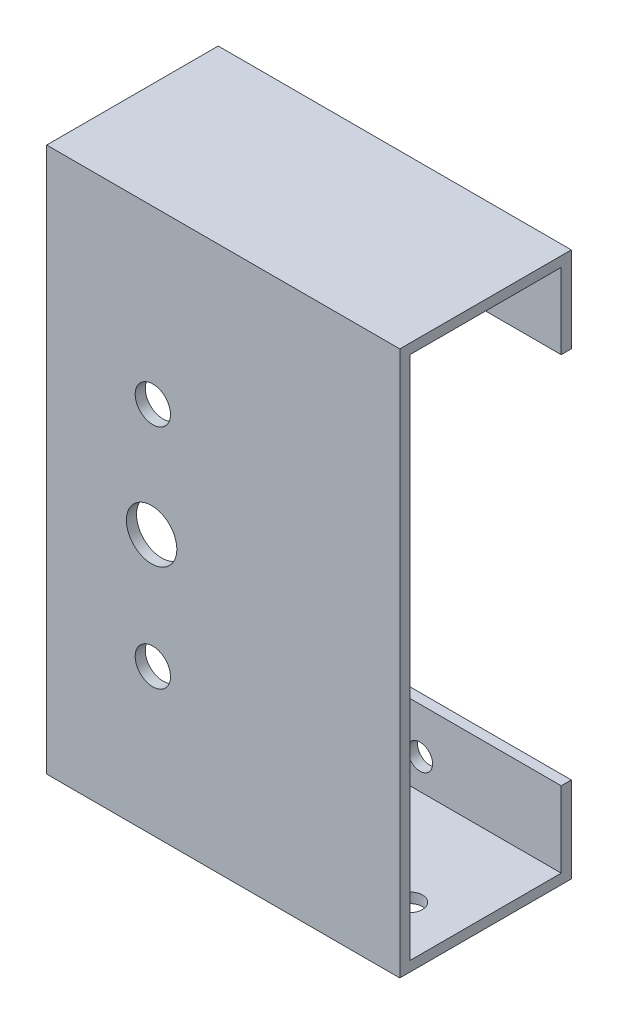
ISO-10303-21;
HEADER;
FILE_DESCRIPTION(('STEP AP214'),'2;1');
FILE_NAME('part.step','',(''),(''),'','','');
FILE_SCHEMA(('AUTOMOTIVE_DESIGN { 1 0 10303 214 1 1 1 1 }'));
ENDSEC;
DATA;
#1=APPLICATION_CONTEXT('core data for automotive mechanical design processes');
#2=APPLICATION_PROTOCOL_DEFINITION('international standard','automotive_design',2000,#1);
#3=PRODUCT_CONTEXT('',#1,'mechanical');
#4=PRODUCT('Part','Part','',(#3));
#5=PRODUCT_RELATED_PRODUCT_CATEGORY('part','',(#4));
#6=PRODUCT_DEFINITION_FORMATION('','',#4);
#7=PRODUCT_DEFINITION_CONTEXT('part definition',#1,'design');
#8=PRODUCT_DEFINITION('design','',#6,#7);
#9=PRODUCT_DEFINITION_SHAPE('','',#8);
#10=(LENGTH_UNIT() NAMED_UNIT(*) SI_UNIT(.MILLI.,.METRE.));
#11=(NAMED_UNIT(*) PLANE_ANGLE_UNIT() SI_UNIT($,.RADIAN.));
#12=(NAMED_UNIT(*) SI_UNIT($,.STERADIAN.) SOLID_ANGLE_UNIT());
#13=UNCERTAINTY_MEASURE_WITH_UNIT(LENGTH_MEASURE(1.E-05),#10,'distance_accuracy_value','');
#14=(GEOMETRIC_REPRESENTATION_CONTEXT(3) GLOBAL_UNCERTAINTY_ASSIGNED_CONTEXT((#13)) GLOBAL_UNIT_ASSIGNED_CONTEXT((#10,
#11,#12)) REPRESENTATION_CONTEXT('',''));
#15=CARTESIAN_POINT('',(0.,0.,0.));
#16=DIRECTION('',(0.,0.,1.));
#17=DIRECTION('',(1.,0.,0.));
#18=AXIS2_PLACEMENT_3D('',#15,#16,#17);
#19=CARTESIAN_POINT('',(0.,0.,0.));
#20=DIRECTION('',(0.,0.,1.));
#21=DIRECTION('',(1.,0.,0.));
#22=AXIS2_PLACEMENT_3D('',#19,#20,#21);
#23=PLANE('',#22);
#24=CARTESIAN_POINT('',(-13.9545492573854,20.0000000000015,0.));
#25=DIRECTION('',(0.,0.,1.));
#26=DIRECTION('',(1.,0.,0.));
#27=AXIS2_PLACEMENT_3D('',#24,#25,#26);
#28=CIRCLE('',#27,3.5);
#29=CARTESIAN_POINT('',(-10.4545492573854,20.0000000000015,0.));
#30=VERTEX_POINT('',#29);
#31=EDGE_CURVE('E557',#30,#30,#28,.T.);
#32=ORIENTED_EDGE('',*,*,#31,.T.);
#33=EDGE_LOOP('',(#32));
#34=FACE_BOUND('',#33,.T.);
#35=CARTESIAN_POINT('',(-13.9545492573854,-24.9999999999985,0.));
#36=DIRECTION('',(0.,0.,1.));
#37=DIRECTION('',(1.,0.,0.));
#38=AXIS2_PLACEMENT_3D('',#35,#36,#37);
#39=CIRCLE('',#38,3.5);
#40=CARTESIAN_POINT('',(-10.4545492573854,-24.9999999999985,0.));
#41=VERTEX_POINT('',#40);
#42=EDGE_CURVE('E549',#41,#41,#39,.T.);
#43=ORIENTED_EDGE('',*,*,#42,.T.);
#44=EDGE_LOOP('',(#43));
#45=FACE_BOUND('',#44,.T.);
#46=CARTESIAN_POINT('',(-14.1999999999985,-2.49999999999849,0.));
#47=DIRECTION('',(0.,0.,1.));
#48=DIRECTION('',(1.,0.,0.));
#49=AXIS2_PLACEMENT_3D('',#46,#47,#48);
#50=CIRCLE('',#49,5.);
#51=CARTESIAN_POINT('',(-9.19999999999849,-2.49999999999849,0.));
#52=VERTEX_POINT('',#51);
#53=EDGE_CURVE('E564',#52,#52,#50,.T.);
#54=ORIENTED_EDGE('',*,*,#53,.T.);
#55=EDGE_LOOP('',(#54));
#56=FACE_BOUND('',#55,.T.);
#57=DIRECTION('',(0.,-1.,0.));
#58=VECTOR('',#57,1.);
#59=CARTESIAN_POINT('',(-35.,-54.,0.));
#60=LINE('',#59,#58);
#61=CARTESIAN_POINT('',(-35.,52.,0.));
#62=VERTEX_POINT('',#61);
#63=CARTESIAN_POINT('',(-35.,-52.,0.));
#64=VERTEX_POINT('',#63);
#65=EDGE_CURVE('E54',#62,#64,#60,.T.);
#66=ORIENTED_EDGE('',*,*,#65,.F.);
#67=DIRECTION('',(1.,0.,0.));
#68=VECTOR('',#67,1.);
#69=CARTESIAN_POINT('',(35.,52.,0.));
#70=LINE('',#69,#68);
#71=CARTESIAN_POINT('',(35.,52.,0.));
#72=VERTEX_POINT('',#71);
#73=EDGE_CURVE('E141',#62,#72,#70,.T.);
#74=ORIENTED_EDGE('',*,*,#73,.T.);
#75=DIRECTION('',(0.,1.,0.));
#76=VECTOR('',#75,1.);
#77=CARTESIAN_POINT('',(35.,-54.,0.));
#78=LINE('',#77,#76);
#79=CARTESIAN_POINT('',(35.,-52.,0.));
#80=VERTEX_POINT('',#79);
#81=EDGE_CURVE('E241',#80,#72,#78,.T.);
#82=ORIENTED_EDGE('',*,*,#81,.F.);
#83=DIRECTION('',(1.,0.,0.));
#84=VECTOR('',#83,1.);
#85=CARTESIAN_POINT('',(35.,-52.,0.));
#86=LINE('',#85,#84);
#87=EDGE_CURVE('E221',#64,#80,#86,.T.);
#88=ORIENTED_EDGE('',*,*,#87,.F.);
#89=EDGE_LOOP('',(#66,#74,#82,#88));
#90=FACE_BOUND('',#89,.T.);
#91=ADVANCED_FACE('F38',(#34,#45,#56,#90),#23,.F.);
#92=CARTESIAN_POINT('',(-35.,-54.,2.));
#93=DIRECTION('',(1.,0.,0.));
#94=DIRECTION('',(0.,0.,-1.));
#95=AXIS2_PLACEMENT_3D('',#92,#93,#94);
#96=PLANE('',#95);
#97=DIRECTION('',(0.,0.,-1.));
#98=VECTOR('',#97,1.);
#99=CARTESIAN_POINT('',(-35.,54.,2.));
#100=LINE('',#99,#98);
#101=CARTESIAN_POINT('',(-35.,54.,2.));
#102=VERTEX_POINT('',#101);
#103=CARTESIAN_POINT('',(-35.,54.,-32.));
#104=VERTEX_POINT('',#103);
#105=EDGE_CURVE('E249',#102,#104,#100,.T.);
#106=ORIENTED_EDGE('',*,*,#105,.T.);
#107=DIRECTION('',(0.,-1.,0.));
#108=VECTOR('',#107,1.);
#109=CARTESIAN_POINT('',(-35.,54.,-32.));
#110=LINE('',#109,#108);
#111=CARTESIAN_POINT('',(-35.,37.,-32.));
#112=VERTEX_POINT('',#111);
#113=EDGE_CURVE('E158',#104,#112,#110,.T.);
#114=ORIENTED_EDGE('',*,*,#113,.T.);
#115=DIRECTION('',(0.,0.,1.));
#116=VECTOR('',#115,1.);
#117=CARTESIAN_POINT('',(-35.,37.,-32.));
#118=LINE('',#117,#116);
#119=CARTESIAN_POINT('',(-35.,37.,-30.));
#120=VERTEX_POINT('',#119);
#121=EDGE_CURVE('E142',#112,#120,#118,.T.);
#122=ORIENTED_EDGE('',*,*,#121,.T.);
#123=DIRECTION('',(0.,-1.,0.));
#124=VECTOR('',#123,1.);
#125=CARTESIAN_POINT('',(-35.,54.,-30.));
#126=LINE('',#125,#124);
#127=CARTESIAN_POINT('',(-35.,52.,-30.));
#128=VERTEX_POINT('',#127);
#129=EDGE_CURVE('E153',#128,#120,#126,.T.);
#130=ORIENTED_EDGE('',*,*,#129,.F.);
#131=DIRECTION('',(0.,0.,1.));
#132=VECTOR('',#131,1.);
#133=CARTESIAN_POINT('',(-35.,52.,-30.));
#134=LINE('',#133,#132);
#135=EDGE_CURVE('E180',#128,#62,#134,.T.);
#136=ORIENTED_EDGE('',*,*,#135,.T.);
#137=ORIENTED_EDGE('',*,*,#65,.T.);
#138=DIRECTION('',(0.,0.,1.));
#139=VECTOR('',#138,1.);
#140=CARTESIAN_POINT('',(-35.,-52.,-30.));
#141=LINE('',#140,#139);
#142=CARTESIAN_POINT('',(-35.,-52.,-30.));
#143=VERTEX_POINT('',#142);
#144=EDGE_CURVE('E233',#143,#64,#141,.T.);
#145=ORIENTED_EDGE('',*,*,#144,.F.);
#146=DIRECTION('',(0.,1.,0.));
#147=VECTOR('',#146,1.);
#148=CARTESIAN_POINT('',(-35.,-54.,-30.));
#149=LINE('',#148,#147);
#150=CARTESIAN_POINT('',(-35.,-37.,-30.));
#151=VERTEX_POINT('',#150);
#152=EDGE_CURVE('E209',#143,#151,#149,.T.);
#153=ORIENTED_EDGE('',*,*,#152,.T.);
#154=DIRECTION('',(0.,0.,1.));
#155=VECTOR('',#154,1.);
#156=CARTESIAN_POINT('',(-35.,-37.,-32.));
#157=LINE('',#156,#155);
#158=CARTESIAN_POINT('',(-35.,-37.,-32.));
#159=VERTEX_POINT('',#158);
#160=EDGE_CURVE('E217',#159,#151,#157,.T.);
#161=ORIENTED_EDGE('',*,*,#160,.F.);
#162=DIRECTION('',(0.,1.,0.));
#163=VECTOR('',#162,1.);
#164=CARTESIAN_POINT('',(-35.,-54.,-32.));
#165=LINE('',#164,#163);
#166=CARTESIAN_POINT('',(-35.,-54.,-32.));
#167=VERTEX_POINT('',#166);
#168=EDGE_CURVE('E199',#167,#159,#165,.T.);
#169=ORIENTED_EDGE('',*,*,#168,.F.);
#170=DIRECTION('',(0.,0.,-1.));
#171=VECTOR('',#170,1.);
#172=CARTESIAN_POINT('',(-35.,-54.,2.));
#173=LINE('',#172,#171);
#174=CARTESIAN_POINT('',(-35.,-54.,2.));
#175=VERTEX_POINT('',#174);
#176=EDGE_CURVE('E11',#175,#167,#173,.T.);
#177=ORIENTED_EDGE('',*,*,#176,.F.);
#178=DIRECTION('',(0.,-1.,0.));
#179=VECTOR('',#178,1.);
#180=CARTESIAN_POINT('',(-35.,-54.,2.));
#181=LINE('',#180,#179);
#182=EDGE_CURVE('E237',#102,#175,#181,.T.);
#183=ORIENTED_EDGE('',*,*,#182,.F.);
#184=EDGE_LOOP('',(#106,#114,#122,#130,#136,#137,#145,#153,#161,#169,#177,#183));
#185=FACE_BOUND('',#184,.T.);
#186=ADVANCED_FACE('F40',(#185),#96,.F.);
#187=CARTESIAN_POINT('',(35.,-54.,2.));
#188=DIRECTION('',(0.,1.,0.));
#189=DIRECTION('',(-1.,0.,0.));
#190=AXIS2_PLACEMENT_3D('',#187,#188,#189);
#191=PLANE('',#190);
#192=CARTESIAN_POINT('',(25.,-54.,-10.));
#193=DIRECTION('',(0.,1.,0.));
#194=DIRECTION('',(-1.,0.,0.));
#195=AXIS2_PLACEMENT_3D('',#192,#193,#194);
#196=CIRCLE('',#195,2.5);
#197=CARTESIAN_POINT('',(22.5,-54.,-10.));
#198=VERTEX_POINT('',#197);
#199=EDGE_CURVE('E324',#198,#198,#196,.T.);
#200=ORIENTED_EDGE('',*,*,#199,.T.);
#201=EDGE_LOOP('',(#200));
#202=FACE_BOUND('',#201,.T.);
#203=CARTESIAN_POINT('',(-25.,-54.,-10.));
#204=DIRECTION('',(0.,1.,0.));
#205=DIRECTION('',(-1.,0.,0.));
#206=AXIS2_PLACEMENT_3D('',#203,#204,#205);
#207=CIRCLE('',#206,2.5);
#208=CARTESIAN_POINT('',(-27.5,-54.,-10.));
#209=VERTEX_POINT('',#208);
#210=EDGE_CURVE('E327',#209,#209,#207,.T.);
#211=ORIENTED_EDGE('',*,*,#210,.T.);
#212=EDGE_LOOP('',(#211));
#213=FACE_BOUND('',#212,.T.);
#214=ORIENTED_EDGE('',*,*,#176,.T.);
#215=DIRECTION('',(-1.,0.,0.));
#216=VECTOR('',#215,1.);
#217=CARTESIAN_POINT('',(35.,-54.,-32.));
#218=LINE('',#217,#216);
#219=CARTESIAN_POINT('',(35.,-54.,-32.));
#220=VERTEX_POINT('',#219);
#221=EDGE_CURVE('E194',#220,#167,#218,.T.);
#222=ORIENTED_EDGE('',*,*,#221,.F.);
#223=DIRECTION('',(0.,0.,-1.));
#224=VECTOR('',#223,1.);
#225=CARTESIAN_POINT('',(35.,-54.,2.));
#226=LINE('',#225,#224);
#227=CARTESIAN_POINT('',(35.,-54.,2.));
#228=VERTEX_POINT('',#227);
#229=EDGE_CURVE('E47',#228,#220,#226,.T.);
#230=ORIENTED_EDGE('',*,*,#229,.F.);
#231=DIRECTION('',(1.,0.,0.));
#232=VECTOR('',#231,1.);
#233=CARTESIAN_POINT('',(35.,-54.,2.));
#234=LINE('',#233,#232);
#235=EDGE_CURVE('E240',#175,#228,#234,.T.);
#236=ORIENTED_EDGE('',*,*,#235,.F.);
#237=EDGE_LOOP('',(#214,#222,#230,#236));
#238=FACE_BOUND('',#237,.T.);
#239=ADVANCED_FACE('F265',(#202,#213,#238),#191,.F.);
#240=CARTESIAN_POINT('',(35.,-54.,2.));
#241=DIRECTION('',(-1.,0.,0.));
#242=DIRECTION('',(0.,0.,1.));
#243=AXIS2_PLACEMENT_3D('',#240,#241,#242);
#244=PLANE('',#243);
#245=ORIENTED_EDGE('',*,*,#229,.T.);
#246=DIRECTION('',(0.,-1.,0.));
#247=VECTOR('',#246,1.);
#248=CARTESIAN_POINT('',(35.,-54.,-32.));
#249=LINE('',#248,#247);
#250=CARTESIAN_POINT('',(35.,-37.,-32.));
#251=VERTEX_POINT('',#250);
#252=EDGE_CURVE('E190',#251,#220,#249,.T.);
#253=ORIENTED_EDGE('',*,*,#252,.F.);
#254=DIRECTION('',(0.,0.,1.));
#255=VECTOR('',#254,1.);
#256=CARTESIAN_POINT('',(35.,-37.,-32.));
#257=LINE('',#256,#255);
#258=CARTESIAN_POINT('',(35.,-37.,-30.));
#259=VERTEX_POINT('',#258);
#260=EDGE_CURVE('E205',#251,#259,#257,.T.);
#261=ORIENTED_EDGE('',*,*,#260,.T.);
#262=DIRECTION('',(0.,-1.,0.));
#263=VECTOR('',#262,1.);
#264=CARTESIAN_POINT('',(35.,-54.,-30.));
#265=LINE('',#264,#263);
#266=CARTESIAN_POINT('',(35.,-52.,-30.));
#267=VERTEX_POINT('',#266);
#268=EDGE_CURVE('E189',#259,#267,#265,.T.);
#269=ORIENTED_EDGE('',*,*,#268,.T.);
#270=DIRECTION('',(0.,0.,1.));
#271=VECTOR('',#270,1.);
#272=CARTESIAN_POINT('',(35.,-52.,-30.));
#273=LINE('',#272,#271);
#274=EDGE_CURVE('E226',#267,#80,#273,.T.);
#275=ORIENTED_EDGE('',*,*,#274,.T.);
#276=ORIENTED_EDGE('',*,*,#81,.T.);
#277=DIRECTION('',(0.,0.,1.));
#278=VECTOR('',#277,1.);
#279=CARTESIAN_POINT('',(35.,52.,-30.));
#280=LINE('',#279,#278);
#281=CARTESIAN_POINT('',(35.,52.,-30.));
#282=VERTEX_POINT('',#281);
#283=EDGE_CURVE('E186',#282,#72,#280,.T.);
#284=ORIENTED_EDGE('',*,*,#283,.F.);
#285=DIRECTION('',(0.,1.,0.));
#286=VECTOR('',#285,1.);
#287=CARTESIAN_POINT('',(35.,54.,-30.));
#288=LINE('',#287,#286);
#289=CARTESIAN_POINT('',(35.,37.,-30.));
#290=VERTEX_POINT('',#289);
#291=EDGE_CURVE('E135',#290,#282,#288,.T.);
#292=ORIENTED_EDGE('',*,*,#291,.F.);
#293=DIRECTION('',(0.,0.,1.));
#294=VECTOR('',#293,1.);
#295=CARTESIAN_POINT('',(35.,37.,-32.));
#296=LINE('',#295,#294);
#297=CARTESIAN_POINT('',(35.,37.,-32.));
#298=VERTEX_POINT('',#297);
#299=EDGE_CURVE('E128',#298,#290,#296,.T.);
#300=ORIENTED_EDGE('',*,*,#299,.F.);
#301=DIRECTION('',(0.,1.,0.));
#302=VECTOR('',#301,1.);
#303=CARTESIAN_POINT('',(35.,54.,-32.));
#304=LINE('',#303,#302);
#305=CARTESIAN_POINT('',(35.,54.,-32.));
#306=VERTEX_POINT('',#305);
#307=EDGE_CURVE('E132',#298,#306,#304,.T.);
#308=ORIENTED_EDGE('',*,*,#307,.T.);
#309=DIRECTION('',(0.,0.,-1.));
#310=VECTOR('',#309,1.);
#311=CARTESIAN_POINT('',(35.,54.,2.));
#312=LINE('',#311,#310);
#313=CARTESIAN_POINT('',(35.,54.,2.));
#314=VERTEX_POINT('',#313);
#315=EDGE_CURVE('E257',#314,#306,#312,.T.);
#316=ORIENTED_EDGE('',*,*,#315,.F.);
#317=DIRECTION('',(0.,1.,0.));
#318=VECTOR('',#317,1.);
#319=CARTESIAN_POINT('',(35.,-54.,2.));
#320=LINE('',#319,#318);
#321=EDGE_CURVE('E244',#228,#314,#320,.T.);
#322=ORIENTED_EDGE('',*,*,#321,.F.);
#323=EDGE_LOOP('',(#245,#253,#261,#269,#275,#276,#284,#292,#300,#308,#316,#322));
#324=FACE_BOUND('',#323,.T.);
#325=ADVANCED_FACE('F130',(#324),#244,.F.);
#326=CARTESIAN_POINT('',(35.,54.,2.));
#327=DIRECTION('',(0.,-1.,0.));
#328=DIRECTION('',(1.,0.,0.));
#329=AXIS2_PLACEMENT_3D('',#326,#327,#328);
#330=PLANE('',#329);
#331=ORIENTED_EDGE('',*,*,#315,.T.);
#332=DIRECTION('',(-1.,0.,0.));
#333=VECTOR('',#332,1.);
#334=CARTESIAN_POINT('',(35.,54.,-32.));
#335=LINE('',#334,#333);
#336=EDGE_CURVE('E151',#306,#104,#335,.T.);
#337=ORIENTED_EDGE('',*,*,#336,.T.);
#338=ORIENTED_EDGE('',*,*,#105,.F.);
#339=DIRECTION('',(-1.,0.,0.));
#340=VECTOR('',#339,1.);
#341=CARTESIAN_POINT('',(35.,54.,2.));
#342=LINE('',#341,#340);
#343=EDGE_CURVE('E62',#314,#102,#342,.T.);
#344=ORIENTED_EDGE('',*,*,#343,.F.);
#345=EDGE_LOOP('',(#331,#337,#338,#344));
#346=FACE_BOUND('',#345,.T.);
#347=ADVANCED_FACE('F293',(#346),#330,.F.);
#348=CARTESIAN_POINT('',(0.,0.,2.));
#349=DIRECTION('',(0.,0.,1.));
#350=DIRECTION('',(1.,0.,0.));
#351=AXIS2_PLACEMENT_3D('',#348,#349,#350);
#352=PLANE('',#351);
#353=CARTESIAN_POINT('',(-13.9545492573854,20.0000000000015,2.));
#354=DIRECTION('',(0.,0.,1.));
#355=DIRECTION('',(1.,0.,0.));
#356=AXIS2_PLACEMENT_3D('',#353,#354,#355);
#357=CIRCLE('',#356,3.5);
#358=CARTESIAN_POINT('',(-10.4545492573854,20.0000000000015,2.));
#359=VERTEX_POINT('',#358);
#360=EDGE_CURVE('E545',#359,#359,#357,.T.);
#361=ORIENTED_EDGE('',*,*,#360,.F.);
#362=EDGE_LOOP('',(#361));
#363=FACE_BOUND('',#362,.T.);
#364=CARTESIAN_POINT('',(-13.9545492573854,-24.9999999999985,2.));
#365=DIRECTION('',(0.,0.,1.));
#366=DIRECTION('',(1.,0.,0.));
#367=AXIS2_PLACEMENT_3D('',#364,#365,#366);
#368=CIRCLE('',#367,3.5);
#369=CARTESIAN_POINT('',(-10.4545492573854,-24.9999999999985,2.));
#370=VERTEX_POINT('',#369);
#371=EDGE_CURVE('E550',#370,#370,#368,.T.);
#372=ORIENTED_EDGE('',*,*,#371,.F.);
#373=EDGE_LOOP('',(#372));
#374=FACE_BOUND('',#373,.T.);
#375=CARTESIAN_POINT('',(-14.1999999999985,-2.49999999999849,2.));
#376=DIRECTION('',(0.,0.,1.));
#377=DIRECTION('',(1.,0.,0.));
#378=AXIS2_PLACEMENT_3D('',#375,#376,#377);
#379=CIRCLE('',#378,5.);
#380=CARTESIAN_POINT('',(-9.19999999999849,-2.49999999999849,2.));
#381=VERTEX_POINT('',#380);
#382=EDGE_CURVE('E560',#381,#381,#379,.T.);
#383=ORIENTED_EDGE('',*,*,#382,.F.);
#384=EDGE_LOOP('',(#383));
#385=FACE_BOUND('',#384,.T.);
#386=ORIENTED_EDGE('',*,*,#182,.T.);
#387=ORIENTED_EDGE('',*,*,#235,.T.);
#388=ORIENTED_EDGE('',*,*,#321,.T.);
#389=ORIENTED_EDGE('',*,*,#343,.T.);
#390=EDGE_LOOP('',(#386,#387,#388,#389));
#391=FACE_BOUND('',#390,.T.);
#392=ADVANCED_FACE('F294',(#363,#374,#385,#391),#352,.T.);
#393=CARTESIAN_POINT('',(35.,-52.,-30.));
#394=DIRECTION('',(0.,-1.,0.));
#395=DIRECTION('',(1.,0.,0.));
#396=AXIS2_PLACEMENT_3D('',#393,#394,#395);
#397=PLANE('',#396);
#398=CARTESIAN_POINT('',(25.,-52.,-10.));
#399=DIRECTION('',(0.,1.,0.));
#400=DIRECTION('',(-1.,0.,0.));
#401=AXIS2_PLACEMENT_3D('',#398,#399,#400);
#402=CIRCLE('',#401,2.5);
#403=CARTESIAN_POINT('',(22.5,-52.,-10.));
#404=VERTEX_POINT('',#403);
#405=EDGE_CURVE('E330',#404,#404,#402,.T.);
#406=ORIENTED_EDGE('',*,*,#405,.F.);
#407=EDGE_LOOP('',(#406));
#408=FACE_BOUND('',#407,.T.);
#409=CARTESIAN_POINT('',(-25.,-52.,-10.));
#410=DIRECTION('',(0.,1.,0.));
#411=DIRECTION('',(1.,0.,0.));
#412=AXIS2_PLACEMENT_3D('',#409,#410,#411);
#413=CIRCLE('',#412,2.5);
#414=CARTESIAN_POINT('',(-22.5,-52.,-10.));
#415=VERTEX_POINT('',#414);
#416=EDGE_CURVE('E337',#415,#415,#413,.T.);
#417=ORIENTED_EDGE('',*,*,#416,.F.);
#418=EDGE_LOOP('',(#417));
#419=FACE_BOUND('',#418,.T.);
#420=ORIENTED_EDGE('',*,*,#87,.T.);
#421=ORIENTED_EDGE('',*,*,#274,.F.);
#422=DIRECTION('',(1.,0.,0.));
#423=VECTOR('',#422,1.);
#424=CARTESIAN_POINT('',(35.,-52.,-30.));
#425=LINE('',#424,#423);
#426=EDGE_CURVE('E222',#143,#267,#425,.T.);
#427=ORIENTED_EDGE('',*,*,#426,.F.);
#428=ORIENTED_EDGE('',*,*,#144,.T.);
#429=EDGE_LOOP('',(#420,#421,#427,#428));
#430=FACE_BOUND('',#429,.T.);
#431=ADVANCED_FACE('F282',(#408,#419,#430),#397,.F.);
#432=CARTESIAN_POINT('',(35.,-37.,-32.));
#433=DIRECTION('',(0.,-1.,0.));
#434=DIRECTION('',(0.,0.,-1.));
#435=AXIS2_PLACEMENT_3D('',#432,#433,#434);
#436=PLANE('',#435);
#437=DIRECTION('',(1.,0.,0.));
#438=VECTOR('',#437,1.);
#439=CARTESIAN_POINT('',(35.,-37.,-30.));
#440=LINE('',#439,#438);
#441=EDGE_CURVE('E195',#151,#259,#440,.T.);
#442=ORIENTED_EDGE('',*,*,#441,.T.);
#443=ORIENTED_EDGE('',*,*,#260,.F.);
#444=DIRECTION('',(1.,0.,0.));
#445=VECTOR('',#444,1.);
#446=CARTESIAN_POINT('',(35.,-37.,-32.));
#447=LINE('',#446,#445);
#448=EDGE_CURVE('E202',#159,#251,#447,.T.);
#449=ORIENTED_EDGE('',*,*,#448,.F.);
#450=ORIENTED_EDGE('',*,*,#160,.T.);
#451=EDGE_LOOP('',(#442,#443,#449,#450));
#452=FACE_BOUND('',#451,.T.);
#453=ADVANCED_FACE('F274',(#452),#436,.F.);
#454=CARTESIAN_POINT('',(0.,0.,-32.));
#455=DIRECTION('',(0.,0.,1.));
#456=DIRECTION('',(1.,0.,0.));
#457=AXIS2_PLACEMENT_3D('',#454,#455,#456);
#458=PLANE('',#457);
#459=CARTESIAN_POINT('',(-25.5,-44.5,-32.));
#460=DIRECTION('',(0.,0.,-1.));
#461=DIRECTION('',(-1.,0.,0.));
#462=AXIS2_PLACEMENT_3D('',#459,#460,#461);
#463=CIRCLE('',#462,2.5);
#464=CARTESIAN_POINT('',(-28.,-44.5,-32.));
#465=VERTEX_POINT('',#464);
#466=EDGE_CURVE('E533',#465,#465,#463,.T.);
#467=ORIENTED_EDGE('',*,*,#466,.F.);
#468=EDGE_LOOP('',(#467));
#469=FACE_BOUND('',#468,.T.);
#470=CARTESIAN_POINT('',(7.00000000000045,-45.9999999999983,-32.));
#471=DIRECTION('',(0.,0.,1.));
#472=DIRECTION('',(1.,0.,0.));
#473=AXIS2_PLACEMENT_3D('',#470,#471,#472);
#474=CIRCLE('',#473,2.49999999999999);
#475=CARTESIAN_POINT('',(9.50000000000044,-45.9999999999983,-32.));
#476=VERTEX_POINT('',#475);
#477=EDGE_CURVE('E169',#476,#476,#474,.T.);
#478=ORIENTED_EDGE('',*,*,#477,.T.);
#479=EDGE_LOOP('',(#478));
#480=FACE_BOUND('',#479,.T.);
#481=ORIENTED_EDGE('',*,*,#252,.T.);
#482=ORIENTED_EDGE('',*,*,#221,.T.);
#483=ORIENTED_EDGE('',*,*,#168,.T.);
#484=ORIENTED_EDGE('',*,*,#448,.T.);
#485=EDGE_LOOP('',(#481,#482,#483,#484));
#486=FACE_BOUND('',#485,.T.);
#487=ADVANCED_FACE('F269',(#469,#480,#486),#458,.F.);
#488=CARTESIAN_POINT('',(0.,0.,-30.));
#489=DIRECTION('',(0.,0.,1.));
#490=DIRECTION('',(1.,0.,0.));
#491=AXIS2_PLACEMENT_3D('',#488,#489,#490);
#492=PLANE('',#491);
#493=CARTESIAN_POINT('',(-25.5,-44.5,-30.));
#494=DIRECTION('',(0.,0.,1.));
#495=DIRECTION('',(1.,0.,0.));
#496=AXIS2_PLACEMENT_3D('',#493,#494,#495);
#497=CIRCLE('',#496,2.5);
#498=CARTESIAN_POINT('',(-23.,-44.5,-30.));
#499=VERTEX_POINT('',#498);
#500=EDGE_CURVE('E530',#499,#499,#497,.F.);
#501=ORIENTED_EDGE('',*,*,#500,.T.);
#502=EDGE_LOOP('',(#501));
#503=FACE_BOUND('',#502,.T.);
#504=CARTESIAN_POINT('',(7.00000000000045,-45.9999999999983,-30.));
#505=DIRECTION('',(0.,0.,1.));
#506=DIRECTION('',(1.,0.,0.));
#507=AXIS2_PLACEMENT_3D('',#504,#505,#506);
#508=CIRCLE('',#507,2.49999999999999);
#509=CARTESIAN_POINT('',(9.50000000000044,-45.9999999999983,-30.));
#510=VERTEX_POINT('',#509);
#511=EDGE_CURVE('E341',#510,#510,#508,.T.);
#512=ORIENTED_EDGE('',*,*,#511,.F.);
#513=EDGE_LOOP('',(#512));
#514=FACE_BOUND('',#513,.T.);
#515=ORIENTED_EDGE('',*,*,#152,.F.);
#516=ORIENTED_EDGE('',*,*,#426,.T.);
#517=ORIENTED_EDGE('',*,*,#268,.F.);
#518=ORIENTED_EDGE('',*,*,#441,.F.);
#519=EDGE_LOOP('',(#515,#516,#517,#518));
#520=FACE_BOUND('',#519,.T.);
#521=ADVANCED_FACE('F279',(#503,#514,#520),#492,.T.);
#522=CARTESIAN_POINT('',(35.,52.,-30.));
#523=DIRECTION('',(0.,-1.,0.));
#524=DIRECTION('',(1.,0.,0.));
#525=AXIS2_PLACEMENT_3D('',#522,#523,#524);
#526=PLANE('',#525);
#527=ORIENTED_EDGE('',*,*,#73,.F.);
#528=ORIENTED_EDGE('',*,*,#135,.F.);
#529=DIRECTION('',(1.,0.,0.));
#530=VECTOR('',#529,1.);
#531=CARTESIAN_POINT('',(35.,52.,-30.));
#532=LINE('',#531,#530);
#533=EDGE_CURVE('E176',#128,#282,#532,.T.);
#534=ORIENTED_EDGE('',*,*,#533,.T.);
#535=ORIENTED_EDGE('',*,*,#283,.T.);
#536=EDGE_LOOP('',(#527,#528,#534,#535));
#537=FACE_BOUND('',#536,.T.);
#538=ADVANCED_FACE('F287',(#537),#526,.T.);
#539=CARTESIAN_POINT('',(35.,37.,-32.));
#540=DIRECTION('',(0.,-1.,0.));
#541=DIRECTION('',(0.,0.,-1.));
#542=AXIS2_PLACEMENT_3D('',#539,#540,#541);
#543=PLANE('',#542);
#544=DIRECTION('',(1.,0.,0.));
#545=VECTOR('',#544,1.);
#546=CARTESIAN_POINT('',(35.,37.,-30.));
#547=LINE('',#546,#545);
#548=EDGE_CURVE('E168',#120,#290,#547,.T.);
#549=ORIENTED_EDGE('',*,*,#548,.F.);
#550=ORIENTED_EDGE('',*,*,#121,.F.);
#551=DIRECTION('',(1.,0.,0.));
#552=VECTOR('',#551,1.);
#553=CARTESIAN_POINT('',(35.,37.,-32.));
#554=LINE('',#553,#552);
#555=EDGE_CURVE('E148',#112,#298,#554,.T.);
#556=ORIENTED_EDGE('',*,*,#555,.T.);
#557=ORIENTED_EDGE('',*,*,#299,.T.);
#558=EDGE_LOOP('',(#549,#550,#556,#557));
#559=FACE_BOUND('',#558,.T.);
#560=ADVANCED_FACE('F155',(#559),#543,.T.);
#561=CARTESIAN_POINT('',(0.,0.,-32.));
#562=DIRECTION('',(0.,0.,1.));
#563=DIRECTION('',(1.,0.,0.));
#564=AXIS2_PLACEMENT_3D('',#561,#562,#563);
#565=PLANE('',#564);
#566=CARTESIAN_POINT('',(-25.5,44.5,-32.));
#567=DIRECTION('',(0.,0.,-1.));
#568=DIRECTION('',(-1.,0.,0.));
#569=AXIS2_PLACEMENT_3D('',#566,#567,#568);
#570=CIRCLE('',#569,2.5);
#571=CARTESIAN_POINT('',(-28.,44.5,-32.));
#572=VERTEX_POINT('',#571);
#573=EDGE_CURVE('E540',#572,#572,#570,.T.);
#574=ORIENTED_EDGE('',*,*,#573,.F.);
#575=EDGE_LOOP('',(#574));
#576=FACE_BOUND('',#575,.T.);
#577=CARTESIAN_POINT('',(18.3000000000026,42.5000000000015,-32.));
#578=DIRECTION('',(0.,0.,1.));
#579=DIRECTION('',(1.,0.,0.));
#580=AXIS2_PLACEMENT_3D('',#577,#578,#579);
#581=CIRCLE('',#580,2.49999999999999);
#582=CARTESIAN_POINT('',(20.8000000000026,42.5000000000015,-32.));
#583=VERTEX_POINT('',#582);
#584=EDGE_CURVE('E345',#583,#583,#581,.T.);
#585=ORIENTED_EDGE('',*,*,#584,.T.);
#586=EDGE_LOOP('',(#585));
#587=FACE_BOUND('',#586,.T.);
#588=ORIENTED_EDGE('',*,*,#307,.F.);
#589=ORIENTED_EDGE('',*,*,#555,.F.);
#590=ORIENTED_EDGE('',*,*,#113,.F.);
#591=ORIENTED_EDGE('',*,*,#336,.F.);
#592=EDGE_LOOP('',(#588,#589,#590,#591));
#593=FACE_BOUND('',#592,.T.);
#594=ADVANCED_FACE('F146',(#576,#587,#593),#565,.F.);
#595=CARTESIAN_POINT('',(0.,0.,-30.));
#596=DIRECTION('',(0.,0.,1.));
#597=DIRECTION('',(1.,0.,0.));
#598=AXIS2_PLACEMENT_3D('',#595,#596,#597);
#599=PLANE('',#598);
#600=CARTESIAN_POINT('',(-25.5,44.5,-30.));
#601=DIRECTION('',(0.,0.,1.));
#602=DIRECTION('',(1.,0.,0.));
#603=AXIS2_PLACEMENT_3D('',#600,#601,#602);
#604=CIRCLE('',#603,2.5);
#605=CARTESIAN_POINT('',(-23.,44.5,-30.));
#606=VERTEX_POINT('',#605);
#607=EDGE_CURVE('E535',#606,#606,#604,.F.);
#608=ORIENTED_EDGE('',*,*,#607,.T.);
#609=EDGE_LOOP('',(#608));
#610=FACE_BOUND('',#609,.T.);
#611=CARTESIAN_POINT('',(18.3000000000026,42.5000000000015,-30.));
#612=DIRECTION('',(0.,0.,1.));
#613=DIRECTION('',(1.,0.,0.));
#614=AXIS2_PLACEMENT_3D('',#611,#612,#613);
#615=CIRCLE('',#614,2.49999999999999);
#616=CARTESIAN_POINT('',(20.8000000000026,42.5000000000015,-30.));
#617=VERTEX_POINT('',#616);
#618=EDGE_CURVE('E334',#617,#617,#615,.T.);
#619=ORIENTED_EDGE('',*,*,#618,.F.);
#620=EDGE_LOOP('',(#619));
#621=FACE_BOUND('',#620,.T.);
#622=ORIENTED_EDGE('',*,*,#291,.T.);
#623=ORIENTED_EDGE('',*,*,#533,.F.);
#624=ORIENTED_EDGE('',*,*,#129,.T.);
#625=ORIENTED_EDGE('',*,*,#548,.T.);
#626=EDGE_LOOP('',(#622,#623,#624,#625));
#627=FACE_BOUND('',#626,.T.);
#628=ADVANCED_FACE('F290',(#610,#621,#627),#599,.T.);
#629=CARTESIAN_POINT('',(18.3000000000026,42.5000000000015,-40.));
#630=DIRECTION('',(0.,0.,1.));
#631=DIRECTION('',(1.,0.,0.));
#632=AXIS2_PLACEMENT_3D('',#629,#630,#631);
#633=CYLINDRICAL_SURFACE('',#632,2.49999999999999);
#634=ORIENTED_EDGE('',*,*,#618,.T.);
#635=EDGE_LOOP('',(#634));
#636=FACE_BOUND('',#635,.T.);
#637=ORIENTED_EDGE('',*,*,#584,.F.);
#638=EDGE_LOOP('',(#637));
#639=FACE_BOUND('',#638,.T.);
#640=ADVANCED_FACE('F359',(#636,#639),#633,.F.);
#641=CARTESIAN_POINT('',(7.00000000000045,-45.9999999999983,-40.));
#642=DIRECTION('',(0.,0.,1.));
#643=DIRECTION('',(1.,0.,0.));
#644=AXIS2_PLACEMENT_3D('',#641,#642,#643);
#645=CYLINDRICAL_SURFACE('',#644,2.49999999999999);
#646=ORIENTED_EDGE('',*,*,#511,.T.);
#647=EDGE_LOOP('',(#646));
#648=FACE_BOUND('',#647,.T.);
#649=ORIENTED_EDGE('',*,*,#477,.F.);
#650=EDGE_LOOP('',(#649));
#651=FACE_BOUND('',#650,.T.);
#652=ADVANCED_FACE('F356',(#648,#651),#645,.F.);
#653=CARTESIAN_POINT('',(-25.,-62.,-10.));
#654=DIRECTION('',(0.,1.,0.));
#655=DIRECTION('',(-1.,0.,0.));
#656=AXIS2_PLACEMENT_3D('',#653,#654,#655);
#657=CYLINDRICAL_SURFACE('',#656,2.5);
#658=ORIENTED_EDGE('',*,*,#416,.T.);
#659=EDGE_LOOP('',(#658));
#660=FACE_BOUND('',#659,.T.);
#661=ORIENTED_EDGE('',*,*,#210,.F.);
#662=EDGE_LOOP('',(#661));
#663=FACE_BOUND('',#662,.T.);
#664=ADVANCED_FACE('F358',(#660,#663),#657,.F.);
#665=CARTESIAN_POINT('',(25.,-62.,-10.));
#666=DIRECTION('',(0.,1.,0.));
#667=DIRECTION('',(-1.,0.,0.));
#668=AXIS2_PLACEMENT_3D('',#665,#666,#667);
#669=CYLINDRICAL_SURFACE('',#668,2.5);
#670=ORIENTED_EDGE('',*,*,#405,.T.);
#671=EDGE_LOOP('',(#670));
#672=FACE_BOUND('',#671,.T.);
#673=ORIENTED_EDGE('',*,*,#199,.F.);
#674=EDGE_LOOP('',(#673));
#675=FACE_BOUND('',#674,.T.);
#676=ADVANCED_FACE('F366',(#672,#675),#669,.F.);
#677=CARTESIAN_POINT('',(-14.1999999999985,-2.49999999999849,-8.));
#678=DIRECTION('',(0.,0.,1.));
#679=DIRECTION('',(1.,0.,0.));
#680=AXIS2_PLACEMENT_3D('',#677,#678,#679);
#681=CYLINDRICAL_SURFACE('',#680,5.);
#682=ORIENTED_EDGE('',*,*,#382,.T.);
#683=EDGE_LOOP('',(#682));
#684=FACE_BOUND('',#683,.T.);
#685=ORIENTED_EDGE('',*,*,#53,.F.);
#686=EDGE_LOOP('',(#685));
#687=FACE_BOUND('',#686,.T.);
#688=ADVANCED_FACE('F466',(#684,#687),#681,.F.);
#689=CARTESIAN_POINT('',(-13.9545492573854,-24.9999999999985,-8.));
#690=DIRECTION('',(0.,0.,1.));
#691=DIRECTION('',(1.,0.,0.));
#692=AXIS2_PLACEMENT_3D('',#689,#690,#691);
#693=CYLINDRICAL_SURFACE('',#692,3.5);
#694=ORIENTED_EDGE('',*,*,#371,.T.);
#695=EDGE_LOOP('',(#694));
#696=FACE_BOUND('',#695,.T.);
#697=ORIENTED_EDGE('',*,*,#42,.F.);
#698=EDGE_LOOP('',(#697));
#699=FACE_BOUND('',#698,.T.);
#700=ADVANCED_FACE('F474',(#696,#699),#693,.F.);
#701=CARTESIAN_POINT('',(-13.9545492573854,20.0000000000015,-8.));
#702=DIRECTION('',(0.,0.,1.));
#703=DIRECTION('',(1.,0.,0.));
#704=AXIS2_PLACEMENT_3D('',#701,#702,#703);
#705=CYLINDRICAL_SURFACE('',#704,3.5);
#706=ORIENTED_EDGE('',*,*,#360,.T.);
#707=EDGE_LOOP('',(#706));
#708=FACE_BOUND('',#707,.T.);
#709=ORIENTED_EDGE('',*,*,#31,.F.);
#710=EDGE_LOOP('',(#709));
#711=FACE_BOUND('',#710,.T.);
#712=ADVANCED_FACE('F494',(#708,#711),#705,.F.);
#713=CARTESIAN_POINT('',(-25.5,44.5,2.001));
#714=DIRECTION('',(0.,0.,-1.));
#715=DIRECTION('',(-1.,0.,0.));
#716=AXIS2_PLACEMENT_3D('',#713,#714,#715);
#717=CYLINDRICAL_SURFACE('',#716,2.5);
#718=ORIENTED_EDGE('',*,*,#607,.F.);
#719=EDGE_LOOP('',(#718));
#720=FACE_BOUND('',#719,.T.);
#721=ORIENTED_EDGE('',*,*,#573,.T.);
#722=EDGE_LOOP('',(#721));
#723=FACE_BOUND('',#722,.T.);
#724=ADVANCED_FACE('F503',(#720,#723),#717,.F.);
#725=CARTESIAN_POINT('',(-25.5,-44.5,2.001));
#726=DIRECTION('',(0.,0.,-1.));
#727=DIRECTION('',(-1.,0.,0.));
#728=AXIS2_PLACEMENT_3D('',#725,#726,#727);
#729=CYLINDRICAL_SURFACE('',#728,2.5);
#730=ORIENTED_EDGE('',*,*,#500,.F.);
#731=EDGE_LOOP('',(#730));
#732=FACE_BOUND('',#731,.T.);
#733=ORIENTED_EDGE('',*,*,#466,.T.);
#734=EDGE_LOOP('',(#733));
#735=FACE_BOUND('',#734,.T.);
#736=ADVANCED_FACE('F513',(#732,#735),#729,.F.);
#737=CLOSED_SHELL('',(#91,#186,#239,#325,#347,#392,#431,#453,#487,#521,#538,#560,#594,#628,#640,
#652,#664,#676,#688,#700,#712,#724,#736));
#738=MANIFOLD_SOLID_BREP('B2',#737);
#739=ADVANCED_BREP_SHAPE_REPRESENTATION('',(#18,#738),#14);
#740=SHAPE_DEFINITION_REPRESENTATION(#9,#739);
ENDSEC;
END-ISO-10303-21;
